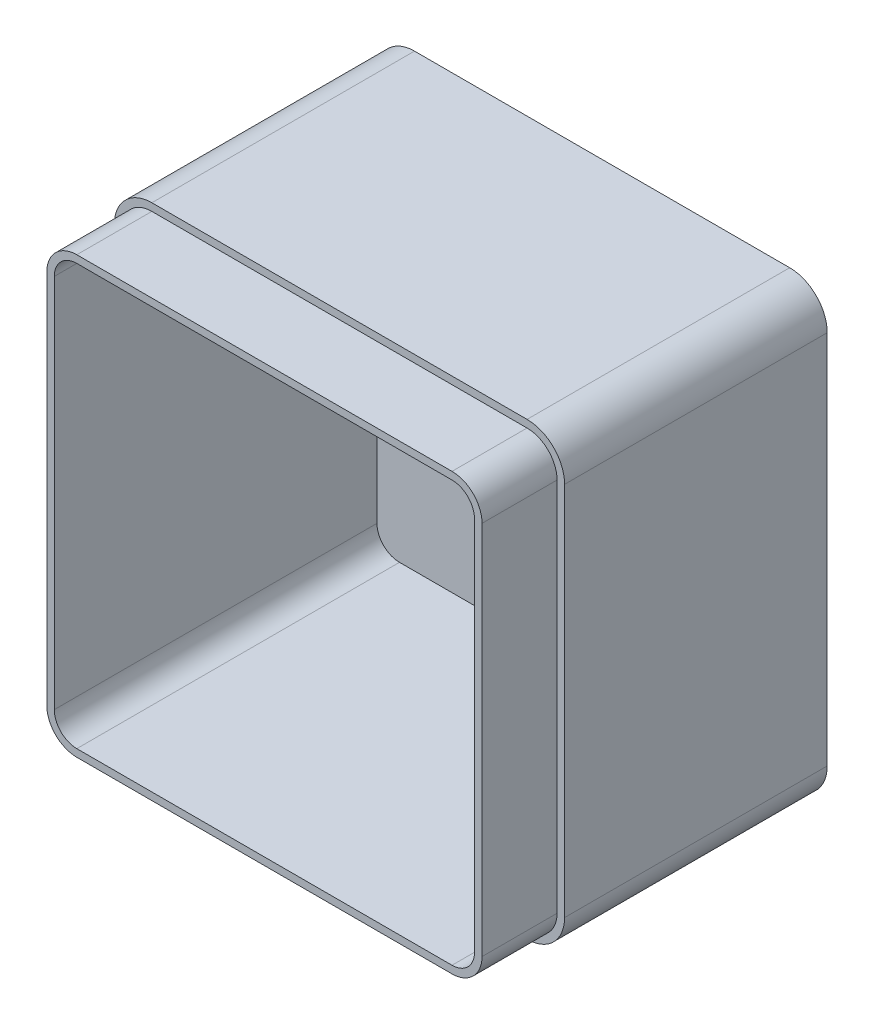
ISO-10303-21;
HEADER;
FILE_DESCRIPTION(('STEP AP214'),'2;1');
FILE_NAME('part.step','',(''),(''),'','','');
FILE_SCHEMA(('AUTOMOTIVE_DESIGN { 1 0 10303 214 1 1 1 1 }'));
ENDSEC;
DATA;
#1=APPLICATION_CONTEXT('core data for automotive mechanical design processes');
#2=APPLICATION_PROTOCOL_DEFINITION('international standard','automotive_design',2000,#1);
#3=PRODUCT_CONTEXT('',#1,'mechanical');
#4=PRODUCT('Part','Part','',(#3));
#5=PRODUCT_RELATED_PRODUCT_CATEGORY('part','',(#4));
#6=PRODUCT_DEFINITION_FORMATION('','',#4);
#7=PRODUCT_DEFINITION_CONTEXT('part definition',#1,'design');
#8=PRODUCT_DEFINITION('design','',#6,#7);
#9=PRODUCT_DEFINITION_SHAPE('','',#8);
#10=(LENGTH_UNIT() NAMED_UNIT(*) SI_UNIT(.MILLI.,.METRE.));
#11=(NAMED_UNIT(*) PLANE_ANGLE_UNIT() SI_UNIT($,.RADIAN.));
#12=(NAMED_UNIT(*) SI_UNIT($,.STERADIAN.) SOLID_ANGLE_UNIT());
#13=UNCERTAINTY_MEASURE_WITH_UNIT(LENGTH_MEASURE(1.E-05),#10,'distance_accuracy_value','');
#14=(GEOMETRIC_REPRESENTATION_CONTEXT(3) GLOBAL_UNCERTAINTY_ASSIGNED_CONTEXT((#13)) GLOBAL_UNIT_ASSIGNED_CONTEXT((#10,
#11,#12)) REPRESENTATION_CONTEXT('',''));
#15=CARTESIAN_POINT('',(0.,0.,0.));
#16=DIRECTION('',(0.,0.,1.));
#17=DIRECTION('',(1.,0.,0.));
#18=AXIS2_PLACEMENT_3D('',#15,#16,#17);
#19=CARTESIAN_POINT('',(0.,0.,90.));
#20=DIRECTION('',(0.,0.,-1.));
#21=DIRECTION('',(-1.,0.,0.));
#22=AXIS2_PLACEMENT_3D('',#19,#20,#21);
#23=PLANE('',#22);
#24=DIRECTION('',(0.,-1.,0.));
#25=VECTOR('',#24,1.);
#26=CARTESIAN_POINT('',(4.,0.,90.));
#27=LINE('',#26,#25);
#28=CARTESIAN_POINT('',(4.,110.,90.));
#29=VERTEX_POINT('',#28);
#30=CARTESIAN_POINT('',(4.,9.99999999999999,90.));
#31=VERTEX_POINT('',#30);
#32=EDGE_CURVE('E306',#29,#31,#27,.T.);
#33=ORIENTED_EDGE('',*,*,#32,.F.);
#34=CARTESIAN_POINT('',(10.,110.,90.));
#35=DIRECTION('',(0.,0.,-1.));
#36=DIRECTION('',(-1.,0.,0.));
#37=AXIS2_PLACEMENT_3D('',#34,#35,#36);
#38=CIRCLE('',#37,6.);
#39=CARTESIAN_POINT('',(9.99999999999999,116.,90.));
#40=VERTEX_POINT('',#39);
#41=EDGE_CURVE('E289',#40,#29,#38,.F.);
#42=ORIENTED_EDGE('',*,*,#41,.F.);
#43=DIRECTION('',(-1.,0.,0.));
#44=VECTOR('',#43,1.);
#45=CARTESIAN_POINT('',(0.,116.,90.));
#46=LINE('',#45,#44);
#47=CARTESIAN_POINT('',(110.,116.,90.));
#48=VERTEX_POINT('',#47);
#49=EDGE_CURVE('E315',#48,#40,#46,.T.);
#50=ORIENTED_EDGE('',*,*,#49,.F.);
#51=CARTESIAN_POINT('',(110.,110.,90.));
#52=DIRECTION('',(0.,0.,-1.));
#53=DIRECTION('',(-1.,0.,0.));
#54=AXIS2_PLACEMENT_3D('',#51,#52,#53);
#55=CIRCLE('',#54,6.);
#56=CARTESIAN_POINT('',(116.,110.,90.));
#57=VERTEX_POINT('',#56);
#58=EDGE_CURVE('E338',#57,#48,#55,.F.);
#59=ORIENTED_EDGE('',*,*,#58,.F.);
#60=DIRECTION('',(0.,1.,0.));
#61=VECTOR('',#60,1.);
#62=CARTESIAN_POINT('',(116.,0.,90.));
#63=LINE('',#62,#61);
#64=CARTESIAN_POINT('',(116.,9.99999999999999,90.));
#65=VERTEX_POINT('',#64);
#66=EDGE_CURVE('E336',#65,#57,#63,.T.);
#67=ORIENTED_EDGE('',*,*,#66,.F.);
#68=CARTESIAN_POINT('',(110.,10.,90.));
#69=DIRECTION('',(0.,0.,-1.));
#70=DIRECTION('',(-1.,0.,0.));
#71=AXIS2_PLACEMENT_3D('',#68,#69,#70);
#72=CIRCLE('',#71,6.);
#73=CARTESIAN_POINT('',(110.,4.,90.));
#74=VERTEX_POINT('',#73);
#75=EDGE_CURVE('E333',#74,#65,#72,.F.);
#76=ORIENTED_EDGE('',*,*,#75,.F.);
#77=DIRECTION('',(1.,0.,0.));
#78=VECTOR('',#77,1.);
#79=CARTESIAN_POINT('',(0.,4.,90.));
#80=LINE('',#79,#78);
#81=CARTESIAN_POINT('',(9.99999999999999,4.,90.));
#82=VERTEX_POINT('',#81);
#83=EDGE_CURVE('E331',#82,#74,#80,.T.);
#84=ORIENTED_EDGE('',*,*,#83,.F.);
#85=CARTESIAN_POINT('',(10.,10.,90.));
#86=DIRECTION('',(0.,0.,-1.));
#87=DIRECTION('',(-1.,0.,0.));
#88=AXIS2_PLACEMENT_3D('',#85,#86,#87);
#89=CIRCLE('',#88,6.);
#90=EDGE_CURVE('E322',#31,#82,#89,.F.);
#91=ORIENTED_EDGE('',*,*,#90,.F.);
#92=EDGE_LOOP('',(#33,#42,#50,#59,#67,#76,#84,#91));
#93=FACE_BOUND('',#92,.T.);
#94=CARTESIAN_POINT('',(10.,110.,90.));
#95=DIRECTION('',(0.,0.,1.));
#96=DIRECTION('',(1.,0.,0.));
#97=AXIS2_PLACEMENT_3D('',#94,#95,#96);
#98=CIRCLE('',#97,8.);
#99=CARTESIAN_POINT('',(9.99999999999999,118.,90.));
#100=VERTEX_POINT('',#99);
#101=CARTESIAN_POINT('',(2.,110.,90.));
#102=VERTEX_POINT('',#101);
#103=EDGE_CURVE('E241',#100,#102,#98,.T.);
#104=ORIENTED_EDGE('',*,*,#103,.T.);
#105=DIRECTION('',(0.,-1.,0.));
#106=VECTOR('',#105,1.);
#107=CARTESIAN_POINT('',(2.,110.,90.));
#108=LINE('',#107,#106);
#109=CARTESIAN_POINT('',(2.,9.99999999999999,90.));
#110=VERTEX_POINT('',#109);
#111=EDGE_CURVE('E201',#102,#110,#108,.T.);
#112=ORIENTED_EDGE('',*,*,#111,.T.);
#113=CARTESIAN_POINT('',(10.,10.,90.));
#114=DIRECTION('',(0.,0.,1.));
#115=DIRECTION('',(1.,0.,0.));
#116=AXIS2_PLACEMENT_3D('',#113,#114,#115);
#117=CIRCLE('',#116,8.);
#118=CARTESIAN_POINT('',(9.99999999999999,2.,90.));
#119=VERTEX_POINT('',#118);
#120=EDGE_CURVE('E50',#110,#119,#117,.T.);
#121=ORIENTED_EDGE('',*,*,#120,.T.);
#122=DIRECTION('',(1.,0.,0.));
#123=VECTOR('',#122,1.);
#124=CARTESIAN_POINT('',(9.99999999999999,2.,90.));
#125=LINE('',#124,#123);
#126=CARTESIAN_POINT('',(110.,2.,90.));
#127=VERTEX_POINT('',#126);
#128=EDGE_CURVE('E245',#119,#127,#125,.T.);
#129=ORIENTED_EDGE('',*,*,#128,.T.);
#130=CARTESIAN_POINT('',(110.,10.,90.));
#131=DIRECTION('',(0.,0.,1.));
#132=DIRECTION('',(1.,0.,0.));
#133=AXIS2_PLACEMENT_3D('',#130,#131,#132);
#134=CIRCLE('',#133,7.99999999999999);
#135=CARTESIAN_POINT('',(118.,10.,90.));
#136=VERTEX_POINT('',#135);
#137=EDGE_CURVE('E248',#127,#136,#134,.T.);
#138=ORIENTED_EDGE('',*,*,#137,.T.);
#139=DIRECTION('',(0.,1.,0.));
#140=VECTOR('',#139,1.);
#141=CARTESIAN_POINT('',(118.,9.99999999999999,90.));
#142=LINE('',#141,#140);
#143=CARTESIAN_POINT('',(118.,110.,90.));
#144=VERTEX_POINT('',#143);
#145=EDGE_CURVE('E251',#136,#144,#142,.T.);
#146=ORIENTED_EDGE('',*,*,#145,.T.);
#147=CARTESIAN_POINT('',(110.,110.,90.));
#148=DIRECTION('',(0.,0.,1.));
#149=DIRECTION('',(1.,0.,0.));
#150=AXIS2_PLACEMENT_3D('',#147,#148,#149);
#151=CIRCLE('',#150,7.99999999999999);
#152=CARTESIAN_POINT('',(110.,118.,90.));
#153=VERTEX_POINT('',#152);
#154=EDGE_CURVE('E224',#144,#153,#151,.T.);
#155=ORIENTED_EDGE('',*,*,#154,.T.);
#156=DIRECTION('',(-1.,0.,0.));
#157=VECTOR('',#156,1.);
#158=CARTESIAN_POINT('',(110.,118.,90.));
#159=LINE('',#158,#157);
#160=EDGE_CURVE('E221',#153,#100,#159,.T.);
#161=ORIENTED_EDGE('',*,*,#160,.T.);
#162=EDGE_LOOP('',(#104,#112,#121,#129,#138,#146,#155,#161));
#163=FACE_BOUND('',#162,.T.);
#164=ADVANCED_FACE('F35',(#93,#163),#23,.F.);
#165=CARTESIAN_POINT('',(4.,0.,90.));
#166=DIRECTION('',(1.,0.,0.));
#167=DIRECTION('',(0.,0.,-1.));
#168=AXIS2_PLACEMENT_3D('',#165,#166,#167);
#169=PLANE('',#168);
#170=DIRECTION('',(0.,-1.,0.));
#171=VECTOR('',#170,1.);
#172=CARTESIAN_POINT('',(4.,0.,4.));
#173=LINE('',#172,#171);
#174=CARTESIAN_POINT('',(4.,110.,4.));
#175=VERTEX_POINT('',#174);
#176=CARTESIAN_POINT('',(4.,9.99999999999999,4.));
#177=VERTEX_POINT('',#176);
#178=EDGE_CURVE('E283',#175,#177,#173,.T.);
#179=ORIENTED_EDGE('',*,*,#178,.F.);
#180=DIRECTION('',(0.,0.,-1.));
#181=VECTOR('',#180,1.);
#182=CARTESIAN_POINT('',(4.,110.,90.));
#183=LINE('',#182,#181);
#184=EDGE_CURVE('E290',#29,#175,#183,.T.);
#185=ORIENTED_EDGE('',*,*,#184,.F.);
#186=ORIENTED_EDGE('',*,*,#32,.T.);
#187=DIRECTION('',(0.,0.,-1.));
#188=VECTOR('',#187,1.);
#189=CARTESIAN_POINT('',(4.,9.99999999999999,90.));
#190=LINE('',#189,#188);
#191=EDGE_CURVE('E287',#177,#31,#190,.F.);
#192=ORIENTED_EDGE('',*,*,#191,.F.);
#193=EDGE_LOOP('',(#179,#185,#186,#192));
#194=FACE_BOUND('',#193,.T.);
#195=ADVANCED_FACE('F428',(#194),#169,.T.);
#196=CARTESIAN_POINT('',(0.,4.,90.));
#197=DIRECTION('',(0.,1.,0.));
#198=DIRECTION('',(0.,0.,1.));
#199=AXIS2_PLACEMENT_3D('',#196,#197,#198);
#200=PLANE('',#199);
#201=ORIENTED_EDGE('',*,*,#83,.T.);
#202=DIRECTION('',(0.,0.,1.));
#203=VECTOR('',#202,1.);
#204=CARTESIAN_POINT('',(110.,4.,90.));
#205=LINE('',#204,#203);
#206=CARTESIAN_POINT('',(110.,4.,4.));
#207=VERTEX_POINT('',#206);
#208=EDGE_CURVE('E313',#207,#74,#205,.T.);
#209=ORIENTED_EDGE('',*,*,#208,.F.);
#210=DIRECTION('',(1.,0.,0.));
#211=VECTOR('',#210,1.);
#212=CARTESIAN_POINT('',(0.,4.,4.));
#213=LINE('',#212,#211);
#214=CARTESIAN_POINT('',(9.99999999999999,4.,4.));
#215=VERTEX_POINT('',#214);
#216=EDGE_CURVE('E286',#215,#207,#213,.T.);
#217=ORIENTED_EDGE('',*,*,#216,.F.);
#218=DIRECTION('',(0.,0.,1.));
#219=VECTOR('',#218,1.);
#220=CARTESIAN_POINT('',(9.99999999999999,4.,90.));
#221=LINE('',#220,#219);
#222=EDGE_CURVE('E302',#82,#215,#221,.F.);
#223=ORIENTED_EDGE('',*,*,#222,.F.);
#224=EDGE_LOOP('',(#201,#209,#217,#223));
#225=FACE_BOUND('',#224,.T.);
#226=ADVANCED_FACE('F433',(#225),#200,.T.);
#227=CARTESIAN_POINT('',(116.,0.,90.));
#228=DIRECTION('',(-1.,0.,0.));
#229=DIRECTION('',(0.,0.,1.));
#230=AXIS2_PLACEMENT_3D('',#227,#228,#229);
#231=PLANE('',#230);
#232=ORIENTED_EDGE('',*,*,#66,.T.);
#233=DIRECTION('',(0.,0.,1.));
#234=VECTOR('',#233,1.);
#235=CARTESIAN_POINT('',(116.,110.,90.));
#236=LINE('',#235,#234);
#237=CARTESIAN_POINT('',(116.,110.,4.));
#238=VERTEX_POINT('',#237);
#239=EDGE_CURVE('E320',#238,#57,#236,.T.);
#240=ORIENTED_EDGE('',*,*,#239,.F.);
#241=DIRECTION('',(0.,1.,0.));
#242=VECTOR('',#241,1.);
#243=CARTESIAN_POINT('',(116.,0.,4.));
#244=LINE('',#243,#242);
#245=CARTESIAN_POINT('',(116.,9.99999999999999,4.));
#246=VERTEX_POINT('',#245);
#247=EDGE_CURVE('E296',#246,#238,#244,.T.);
#248=ORIENTED_EDGE('',*,*,#247,.F.);
#249=DIRECTION('',(0.,0.,1.));
#250=VECTOR('',#249,1.);
#251=CARTESIAN_POINT('',(116.,9.99999999999999,90.));
#252=LINE('',#251,#250);
#253=EDGE_CURVE('E316',#65,#246,#252,.F.);
#254=ORIENTED_EDGE('',*,*,#253,.F.);
#255=EDGE_LOOP('',(#232,#240,#248,#254));
#256=FACE_BOUND('',#255,.T.);
#257=ADVANCED_FACE('F462',(#256),#231,.T.);
#258=CARTESIAN_POINT('',(0.,116.,90.));
#259=DIRECTION('',(0.,-1.,0.));
#260=DIRECTION('',(0.,0.,-1.));
#261=AXIS2_PLACEMENT_3D('',#258,#259,#260);
#262=PLANE('',#261);
#263=ORIENTED_EDGE('',*,*,#49,.T.);
#264=DIRECTION('',(0.,0.,-1.));
#265=VECTOR('',#264,1.);
#266=CARTESIAN_POINT('',(9.99999999999999,116.,90.));
#267=LINE('',#266,#265);
#268=CARTESIAN_POINT('',(9.99999999999999,116.,4.));
#269=VERTEX_POINT('',#268);
#270=EDGE_CURVE('E319',#269,#40,#267,.F.);
#271=ORIENTED_EDGE('',*,*,#270,.F.);
#272=DIRECTION('',(-1.,0.,0.));
#273=VECTOR('',#272,1.);
#274=CARTESIAN_POINT('',(0.,116.,4.));
#275=LINE('',#274,#273);
#276=CARTESIAN_POINT('',(110.,116.,4.));
#277=VERTEX_POINT('',#276);
#278=EDGE_CURVE('E303',#277,#269,#275,.T.);
#279=ORIENTED_EDGE('',*,*,#278,.F.);
#280=DIRECTION('',(0.,0.,-1.));
#281=VECTOR('',#280,1.);
#282=CARTESIAN_POINT('',(110.,116.,90.));
#283=LINE('',#282,#281);
#284=EDGE_CURVE('E323',#48,#277,#283,.T.);
#285=ORIENTED_EDGE('',*,*,#284,.F.);
#286=EDGE_LOOP('',(#263,#271,#279,#285));
#287=FACE_BOUND('',#286,.T.);
#288=ADVANCED_FACE('F458',(#287),#262,.T.);
#289=CARTESIAN_POINT('',(0.,0.,4.));
#290=DIRECTION('',(0.,0.,-1.));
#291=DIRECTION('',(-1.,0.,0.));
#292=AXIS2_PLACEMENT_3D('',#289,#290,#291);
#293=PLANE('',#292);
#294=ORIENTED_EDGE('',*,*,#216,.T.);
#295=CARTESIAN_POINT('',(110.,10.,4.));
#296=DIRECTION('',(0.,0.,-1.));
#297=DIRECTION('',(-1.,0.,0.));
#298=AXIS2_PLACEMENT_3D('',#295,#296,#297);
#299=CIRCLE('',#298,6.);
#300=EDGE_CURVE('E298',#246,#207,#299,.T.);
#301=ORIENTED_EDGE('',*,*,#300,.F.);
#302=ORIENTED_EDGE('',*,*,#247,.T.);
#303=CARTESIAN_POINT('',(110.,110.,4.));
#304=DIRECTION('',(0.,0.,-1.));
#305=DIRECTION('',(-1.,0.,0.));
#306=AXIS2_PLACEMENT_3D('',#303,#304,#305);
#307=CIRCLE('',#306,6.);
#308=EDGE_CURVE('E301',#277,#238,#307,.T.);
#309=ORIENTED_EDGE('',*,*,#308,.F.);
#310=ORIENTED_EDGE('',*,*,#278,.T.);
#311=CARTESIAN_POINT('',(10.,110.,4.));
#312=DIRECTION('',(0.,0.,-1.));
#313=DIRECTION('',(-1.,0.,0.));
#314=AXIS2_PLACEMENT_3D('',#311,#312,#313);
#315=CIRCLE('',#314,6.);
#316=EDGE_CURVE('E299',#175,#269,#315,.T.);
#317=ORIENTED_EDGE('',*,*,#316,.F.);
#318=ORIENTED_EDGE('',*,*,#178,.T.);
#319=CARTESIAN_POINT('',(10.,10.,4.));
#320=DIRECTION('',(0.,0.,-1.));
#321=DIRECTION('',(-1.,0.,0.));
#322=AXIS2_PLACEMENT_3D('',#319,#320,#321);
#323=CIRCLE('',#322,6.);
#324=EDGE_CURVE('E293',#215,#177,#323,.T.);
#325=ORIENTED_EDGE('',*,*,#324,.F.);
#326=EDGE_LOOP('',(#294,#301,#302,#309,#310,#317,#318,#325));
#327=FACE_BOUND('',#326,.T.);
#328=ADVANCED_FACE('F454',(#327),#293,.F.);
#329=CARTESIAN_POINT('',(10.,10.,90.));
#330=DIRECTION('',(0.,0.,-1.));
#331=DIRECTION('',(-1.,0.,0.));
#332=AXIS2_PLACEMENT_3D('',#329,#330,#331);
#333=CYLINDRICAL_SURFACE('',#332,6.);
#334=ORIENTED_EDGE('',*,*,#90,.T.);
#335=ORIENTED_EDGE('',*,*,#222,.T.);
#336=ORIENTED_EDGE('',*,*,#324,.T.);
#337=ORIENTED_EDGE('',*,*,#191,.T.);
#338=EDGE_LOOP('',(#334,#335,#336,#337));
#339=FACE_BOUND('',#338,.T.);
#340=ADVANCED_FACE('F450',(#339),#333,.F.);
#341=CARTESIAN_POINT('',(110.,10.,90.));
#342=DIRECTION('',(0.,0.,-1.));
#343=DIRECTION('',(-1.,0.,0.));
#344=AXIS2_PLACEMENT_3D('',#341,#342,#343);
#345=CYLINDRICAL_SURFACE('',#344,6.);
#346=ORIENTED_EDGE('',*,*,#75,.T.);
#347=ORIENTED_EDGE('',*,*,#253,.T.);
#348=ORIENTED_EDGE('',*,*,#300,.T.);
#349=ORIENTED_EDGE('',*,*,#208,.T.);
#350=EDGE_LOOP('',(#346,#347,#348,#349));
#351=FACE_BOUND('',#350,.T.);
#352=ADVANCED_FACE('F446',(#351),#345,.F.);
#353=CARTESIAN_POINT('',(110.,110.,90.));
#354=DIRECTION('',(0.,0.,-1.));
#355=DIRECTION('',(-1.,0.,0.));
#356=AXIS2_PLACEMENT_3D('',#353,#354,#355);
#357=CYLINDRICAL_SURFACE('',#356,6.);
#358=ORIENTED_EDGE('',*,*,#58,.T.);
#359=ORIENTED_EDGE('',*,*,#284,.T.);
#360=ORIENTED_EDGE('',*,*,#308,.T.);
#361=ORIENTED_EDGE('',*,*,#239,.T.);
#362=EDGE_LOOP('',(#358,#359,#360,#361));
#363=FACE_BOUND('',#362,.T.);
#364=ADVANCED_FACE('F442',(#363),#357,.F.);
#365=CARTESIAN_POINT('',(10.,110.,90.));
#366=DIRECTION('',(0.,0.,-1.));
#367=DIRECTION('',(-1.,0.,0.));
#368=AXIS2_PLACEMENT_3D('',#365,#366,#367);
#369=CYLINDRICAL_SURFACE('',#368,6.);
#370=ORIENTED_EDGE('',*,*,#41,.T.);
#371=ORIENTED_EDGE('',*,*,#184,.T.);
#372=ORIENTED_EDGE('',*,*,#316,.T.);
#373=ORIENTED_EDGE('',*,*,#270,.T.);
#374=EDGE_LOOP('',(#370,#371,#372,#373));
#375=FACE_BOUND('',#374,.T.);
#376=ADVANCED_FACE('F439',(#375),#369,.F.);
#377=CARTESIAN_POINT('',(10.,110.,70.));
#378=DIRECTION('',(0.,0.,1.));
#379=DIRECTION('',(1.,0.,0.));
#380=AXIS2_PLACEMENT_3D('',#377,#378,#379);
#381=PLANE('',#380);
#382=DIRECTION('',(-1.,0.,0.));
#383=VECTOR('',#382,1.);
#384=CARTESIAN_POINT('',(110.,118.,70.));
#385=LINE('',#384,#383);
#386=CARTESIAN_POINT('',(110.,118.,70.));
#387=VERTEX_POINT('',#386);
#388=CARTESIAN_POINT('',(9.99999999999999,118.,70.));
#389=VERTEX_POINT('',#388);
#390=EDGE_CURVE('E207',#387,#389,#385,.T.);
#391=ORIENTED_EDGE('',*,*,#390,.F.);
#392=CARTESIAN_POINT('',(110.,110.,70.));
#393=DIRECTION('',(0.,0.,1.));
#394=DIRECTION('',(1.,0.,0.));
#395=AXIS2_PLACEMENT_3D('',#392,#393,#394);
#396=CIRCLE('',#395,7.99999999999999);
#397=CARTESIAN_POINT('',(118.,110.,70.));
#398=VERTEX_POINT('',#397);
#399=EDGE_CURVE('E237',#398,#387,#396,.T.);
#400=ORIENTED_EDGE('',*,*,#399,.F.);
#401=DIRECTION('',(0.,1.,0.));
#402=VECTOR('',#401,1.);
#403=CARTESIAN_POINT('',(118.,9.99999999999999,70.));
#404=LINE('',#403,#402);
#405=CARTESIAN_POINT('',(118.,10.,70.));
#406=VERTEX_POINT('',#405);
#407=EDGE_CURVE('E234',#406,#398,#404,.T.);
#408=ORIENTED_EDGE('',*,*,#407,.F.);
#409=CARTESIAN_POINT('',(110.,10.,70.));
#410=DIRECTION('',(0.,0.,1.));
#411=DIRECTION('',(1.,0.,0.));
#412=AXIS2_PLACEMENT_3D('',#409,#410,#411);
#413=CIRCLE('',#412,7.99999999999999);
#414=CARTESIAN_POINT('',(110.,2.,70.));
#415=VERTEX_POINT('',#414);
#416=EDGE_CURVE('E231',#415,#406,#413,.T.);
#417=ORIENTED_EDGE('',*,*,#416,.F.);
#418=DIRECTION('',(1.,0.,0.));
#419=VECTOR('',#418,1.);
#420=CARTESIAN_POINT('',(9.99999999999999,2.,70.));
#421=LINE('',#420,#419);
#422=CARTESIAN_POINT('',(9.99999999999999,2.,70.));
#423=VERTEX_POINT('',#422);
#424=EDGE_CURVE('E228',#423,#415,#421,.T.);
#425=ORIENTED_EDGE('',*,*,#424,.F.);
#426=CARTESIAN_POINT('',(10.,10.,70.));
#427=DIRECTION('',(0.,0.,1.));
#428=DIRECTION('',(1.,0.,0.));
#429=AXIS2_PLACEMENT_3D('',#426,#427,#428);
#430=CIRCLE('',#429,8.);
#431=CARTESIAN_POINT('',(2.,9.99999999999999,70.));
#432=VERTEX_POINT('',#431);
#433=EDGE_CURVE('E217',#432,#423,#430,.T.);
#434=ORIENTED_EDGE('',*,*,#433,.F.);
#435=DIRECTION('',(0.,-1.,0.));
#436=VECTOR('',#435,1.);
#437=CARTESIAN_POINT('',(2.,110.,70.));
#438=LINE('',#437,#436);
#439=CARTESIAN_POINT('',(2.,110.,70.));
#440=VERTEX_POINT('',#439);
#441=EDGE_CURVE('E199',#440,#432,#438,.T.);
#442=ORIENTED_EDGE('',*,*,#441,.F.);
#443=CARTESIAN_POINT('',(10.,110.,70.));
#444=DIRECTION('',(0.,0.,1.));
#445=DIRECTION('',(1.,0.,0.));
#446=AXIS2_PLACEMENT_3D('',#443,#444,#445);
#447=CIRCLE('',#446,8.);
#448=EDGE_CURVE('E213',#389,#440,#447,.T.);
#449=ORIENTED_EDGE('',*,*,#448,.F.);
#450=EDGE_LOOP('',(#391,#400,#408,#417,#425,#434,#442,#449));
#451=FACE_BOUND('',#450,.T.);
#452=CARTESIAN_POINT('',(10.,110.,70.));
#453=DIRECTION('',(0.,0.,1.));
#454=DIRECTION('',(1.,0.,0.));
#455=AXIS2_PLACEMENT_3D('',#452,#453,#454);
#456=CIRCLE('',#455,10.);
#457=CARTESIAN_POINT('',(10.,120.,70.));
#458=VERTEX_POINT('',#457);
#459=CARTESIAN_POINT('',(0.,110.,70.));
#460=VERTEX_POINT('',#459);
#461=EDGE_CURVE('E257',#458,#460,#456,.T.);
#462=ORIENTED_EDGE('',*,*,#461,.T.);
#463=DIRECTION('',(0.,-1.,0.));
#464=VECTOR('',#463,1.);
#465=CARTESIAN_POINT('',(0.,110.,70.));
#466=LINE('',#465,#464);
#467=CARTESIAN_POINT('',(0.,10.,70.));
#468=VERTEX_POINT('',#467);
#469=EDGE_CURVE('E270',#460,#468,#466,.T.);
#470=ORIENTED_EDGE('',*,*,#469,.T.);
#471=CARTESIAN_POINT('',(10.,10.,70.));
#472=DIRECTION('',(0.,0.,1.));
#473=DIRECTION('',(1.,0.,0.));
#474=AXIS2_PLACEMENT_3D('',#471,#472,#473);
#475=CIRCLE('',#474,10.);
#476=CARTESIAN_POINT('',(9.99999999999999,0.,70.));
#477=VERTEX_POINT('',#476);
#478=EDGE_CURVE('E272',#468,#477,#475,.T.);
#479=ORIENTED_EDGE('',*,*,#478,.T.);
#480=DIRECTION('',(1.,0.,0.));
#481=VECTOR('',#480,1.);
#482=CARTESIAN_POINT('',(9.99999999999999,0.,70.));
#483=LINE('',#482,#481);
#484=CARTESIAN_POINT('',(110.,0.,70.));
#485=VERTEX_POINT('',#484);
#486=EDGE_CURVE('E274',#477,#485,#483,.T.);
#487=ORIENTED_EDGE('',*,*,#486,.T.);
#488=CARTESIAN_POINT('',(110.,10.,70.));
#489=DIRECTION('',(0.,0.,1.));
#490=DIRECTION('',(1.,0.,0.));
#491=AXIS2_PLACEMENT_3D('',#488,#489,#490);
#492=CIRCLE('',#491,9.99999999999999);
#493=CARTESIAN_POINT('',(120.,10.,70.));
#494=VERTEX_POINT('',#493);
#495=EDGE_CURVE('E276',#485,#494,#492,.T.);
#496=ORIENTED_EDGE('',*,*,#495,.T.);
#497=DIRECTION('',(0.,1.,0.));
#498=VECTOR('',#497,1.);
#499=CARTESIAN_POINT('',(120.,10.,70.));
#500=LINE('',#499,#498);
#501=CARTESIAN_POINT('',(120.,110.,70.));
#502=VERTEX_POINT('',#501);
#503=EDGE_CURVE('E278',#494,#502,#500,.T.);
#504=ORIENTED_EDGE('',*,*,#503,.T.);
#505=CARTESIAN_POINT('',(110.,110.,70.));
#506=DIRECTION('',(0.,0.,1.));
#507=DIRECTION('',(1.,0.,0.));
#508=AXIS2_PLACEMENT_3D('',#505,#506,#507);
#509=CIRCLE('',#508,9.99999999999999);
#510=CARTESIAN_POINT('',(110.,120.,70.));
#511=VERTEX_POINT('',#510);
#512=EDGE_CURVE('E280',#502,#511,#509,.T.);
#513=ORIENTED_EDGE('',*,*,#512,.T.);
#514=DIRECTION('',(-1.,0.,0.));
#515=VECTOR('',#514,1.);
#516=CARTESIAN_POINT('',(110.,120.,70.));
#517=LINE('',#516,#515);
#518=EDGE_CURVE('E58',#511,#458,#517,.T.);
#519=ORIENTED_EDGE('',*,*,#518,.T.);
#520=EDGE_LOOP('',(#462,#470,#479,#487,#496,#504,#513,#519));
#521=FACE_BOUND('',#520,.T.);
#522=ADVANCED_FACE('F212',(#451,#521),#381,.T.);
#523=CARTESIAN_POINT('',(10.,110.,70.));
#524=DIRECTION('',(0.,0.,1.));
#525=DIRECTION('',(1.,0.,0.));
#526=AXIS2_PLACEMENT_3D('',#523,#524,#525);
#527=CYLINDRICAL_SURFACE('',#526,8.);
#528=ORIENTED_EDGE('',*,*,#103,.F.);
#529=DIRECTION('',(0.,0.,1.));
#530=VECTOR('',#529,1.);
#531=CARTESIAN_POINT('',(9.99999999999999,118.,70.));
#532=LINE('',#531,#530);
#533=EDGE_CURVE('E220',#389,#100,#532,.T.);
#534=ORIENTED_EDGE('',*,*,#533,.F.);
#535=ORIENTED_EDGE('',*,*,#448,.T.);
#536=DIRECTION('',(0.,0.,1.));
#537=VECTOR('',#536,1.);
#538=CARTESIAN_POINT('',(2.,110.,70.));
#539=LINE('',#538,#537);
#540=EDGE_CURVE('E196',#440,#102,#539,.T.);
#541=ORIENTED_EDGE('',*,*,#540,.T.);
#542=EDGE_LOOP('',(#528,#534,#535,#541));
#543=FACE_BOUND('',#542,.T.);
#544=ADVANCED_FACE('F219',(#543),#527,.T.);
#545=CARTESIAN_POINT('',(110.,118.,70.));
#546=DIRECTION('',(0.,1.,0.));
#547=DIRECTION('',(0.,0.,1.));
#548=AXIS2_PLACEMENT_3D('',#545,#546,#547);
#549=PLANE('',#548);
#550=ORIENTED_EDGE('',*,*,#160,.F.);
#551=DIRECTION('',(0.,0.,1.));
#552=VECTOR('',#551,1.);
#553=CARTESIAN_POINT('',(110.,118.,70.));
#554=LINE('',#553,#552);
#555=EDGE_CURVE('E258',#387,#153,#554,.T.);
#556=ORIENTED_EDGE('',*,*,#555,.F.);
#557=ORIENTED_EDGE('',*,*,#390,.T.);
#558=ORIENTED_EDGE('',*,*,#533,.T.);
#559=EDGE_LOOP('',(#550,#556,#557,#558));
#560=FACE_BOUND('',#559,.T.);
#561=ADVANCED_FACE('F473',(#560),#549,.T.);
#562=CARTESIAN_POINT('',(110.,110.,70.));
#563=DIRECTION('',(0.,0.,1.));
#564=DIRECTION('',(1.,0.,0.));
#565=AXIS2_PLACEMENT_3D('',#562,#563,#564);
#566=CYLINDRICAL_SURFACE('',#565,7.99999999999999);
#567=ORIENTED_EDGE('',*,*,#154,.F.);
#568=DIRECTION('',(0.,0.,1.));
#569=VECTOR('',#568,1.);
#570=CARTESIAN_POINT('',(118.,110.,70.));
#571=LINE('',#570,#569);
#572=EDGE_CURVE('E260',#398,#144,#571,.T.);
#573=ORIENTED_EDGE('',*,*,#572,.F.);
#574=ORIENTED_EDGE('',*,*,#399,.T.);
#575=ORIENTED_EDGE('',*,*,#555,.T.);
#576=EDGE_LOOP('',(#567,#573,#574,#575));
#577=FACE_BOUND('',#576,.T.);
#578=ADVANCED_FACE('F488',(#577),#566,.T.);
#579=CARTESIAN_POINT('',(118.,9.99999999999999,70.));
#580=DIRECTION('',(1.,0.,0.));
#581=DIRECTION('',(0.,0.,-1.));
#582=AXIS2_PLACEMENT_3D('',#579,#580,#581);
#583=PLANE('',#582);
#584=ORIENTED_EDGE('',*,*,#145,.F.);
#585=DIRECTION('',(0.,0.,1.));
#586=VECTOR('',#585,1.);
#587=CARTESIAN_POINT('',(118.,10.,70.));
#588=LINE('',#587,#586);
#589=EDGE_CURVE('E262',#406,#136,#588,.T.);
#590=ORIENTED_EDGE('',*,*,#589,.F.);
#591=ORIENTED_EDGE('',*,*,#407,.T.);
#592=ORIENTED_EDGE('',*,*,#572,.T.);
#593=EDGE_LOOP('',(#584,#590,#591,#592));
#594=FACE_BOUND('',#593,.T.);
#595=ADVANCED_FACE('F484',(#594),#583,.T.);
#596=CARTESIAN_POINT('',(110.,10.,70.));
#597=DIRECTION('',(0.,0.,1.));
#598=DIRECTION('',(1.,0.,0.));
#599=AXIS2_PLACEMENT_3D('',#596,#597,#598);
#600=CYLINDRICAL_SURFACE('',#599,7.99999999999999);
#601=ORIENTED_EDGE('',*,*,#137,.F.);
#602=DIRECTION('',(0.,0.,1.));
#603=VECTOR('',#602,1.);
#604=CARTESIAN_POINT('',(110.,2.,70.));
#605=LINE('',#604,#603);
#606=EDGE_CURVE('E264',#415,#127,#605,.T.);
#607=ORIENTED_EDGE('',*,*,#606,.F.);
#608=ORIENTED_EDGE('',*,*,#416,.T.);
#609=ORIENTED_EDGE('',*,*,#589,.T.);
#610=EDGE_LOOP('',(#601,#607,#608,#609));
#611=FACE_BOUND('',#610,.T.);
#612=ADVANCED_FACE('F480',(#611),#600,.T.);
#613=CARTESIAN_POINT('',(9.99999999999999,2.,70.));
#614=DIRECTION('',(0.,-1.,0.));
#615=DIRECTION('',(0.,0.,-1.));
#616=AXIS2_PLACEMENT_3D('',#613,#614,#615);
#617=PLANE('',#616);
#618=ORIENTED_EDGE('',*,*,#128,.F.);
#619=DIRECTION('',(0.,0.,1.));
#620=VECTOR('',#619,1.);
#621=CARTESIAN_POINT('',(9.99999999999999,2.,70.));
#622=LINE('',#621,#620);
#623=EDGE_CURVE('E266',#423,#119,#622,.T.);
#624=ORIENTED_EDGE('',*,*,#623,.F.);
#625=ORIENTED_EDGE('',*,*,#424,.T.);
#626=ORIENTED_EDGE('',*,*,#606,.T.);
#627=EDGE_LOOP('',(#618,#624,#625,#626));
#628=FACE_BOUND('',#627,.T.);
#629=ADVANCED_FACE('F477',(#628),#617,.T.);
#630=CARTESIAN_POINT('',(10.,10.,70.));
#631=DIRECTION('',(0.,0.,1.));
#632=DIRECTION('',(1.,0.,0.));
#633=AXIS2_PLACEMENT_3D('',#630,#631,#632);
#634=CYLINDRICAL_SURFACE('',#633,8.);
#635=ORIENTED_EDGE('',*,*,#120,.F.);
#636=DIRECTION('',(0.,0.,1.));
#637=VECTOR('',#636,1.);
#638=CARTESIAN_POINT('',(2.,9.99999999999999,70.));
#639=LINE('',#638,#637);
#640=EDGE_CURVE('E206',#432,#110,#639,.T.);
#641=ORIENTED_EDGE('',*,*,#640,.F.);
#642=ORIENTED_EDGE('',*,*,#433,.T.);
#643=ORIENTED_EDGE('',*,*,#623,.T.);
#644=EDGE_LOOP('',(#635,#641,#642,#643));
#645=FACE_BOUND('',#644,.T.);
#646=ADVANCED_FACE('F423',(#645),#634,.T.);
#647=CARTESIAN_POINT('',(2.,110.,70.));
#648=DIRECTION('',(-1.,0.,0.));
#649=DIRECTION('',(0.,0.,1.));
#650=AXIS2_PLACEMENT_3D('',#647,#648,#649);
#651=PLANE('',#650);
#652=ORIENTED_EDGE('',*,*,#111,.F.);
#653=ORIENTED_EDGE('',*,*,#540,.F.);
#654=ORIENTED_EDGE('',*,*,#441,.T.);
#655=ORIENTED_EDGE('',*,*,#640,.T.);
#656=EDGE_LOOP('',(#652,#653,#654,#655));
#657=FACE_BOUND('',#656,.T.);
#658=ADVANCED_FACE('F198',(#657),#651,.T.);
#659=CARTESIAN_POINT('',(0.,0.,0.));
#660=DIRECTION('',(0.,0.,-1.));
#661=DIRECTION('',(-1.,0.,0.));
#662=AXIS2_PLACEMENT_3D('',#659,#660,#661);
#663=PLANE('',#662);
#664=DIRECTION('',(1.,0.,0.));
#665=VECTOR('',#664,1.);
#666=CARTESIAN_POINT('',(0.,0.,0.));
#667=LINE('',#666,#665);
#668=CARTESIAN_POINT('',(10.,0.,0.));
#669=VERTEX_POINT('',#668);
#670=CARTESIAN_POINT('',(110.,0.,0.));
#671=VERTEX_POINT('',#670);
#672=EDGE_CURVE('E346',#669,#671,#667,.T.);
#673=ORIENTED_EDGE('',*,*,#672,.F.);
#674=CARTESIAN_POINT('',(10.,10.,0.));
#675=DIRECTION('',(0.,0.,-1.));
#676=DIRECTION('',(-1.,0.,0.));
#677=AXIS2_PLACEMENT_3D('',#674,#675,#676);
#678=CIRCLE('',#677,10.);
#679=CARTESIAN_POINT('',(0.,10.,0.));
#680=VERTEX_POINT('',#679);
#681=EDGE_CURVE('E366',#669,#680,#678,.T.);
#682=ORIENTED_EDGE('',*,*,#681,.T.);
#683=DIRECTION('',(0.,-1.,0.));
#684=VECTOR('',#683,1.);
#685=CARTESIAN_POINT('',(0.,0.,0.));
#686=LINE('',#685,#684);
#687=CARTESIAN_POINT('',(0.,110.,0.));
#688=VERTEX_POINT('',#687);
#689=EDGE_CURVE('E326',#688,#680,#686,.T.);
#690=ORIENTED_EDGE('',*,*,#689,.F.);
#691=CARTESIAN_POINT('',(10.,110.,0.));
#692=DIRECTION('',(0.,0.,-1.));
#693=DIRECTION('',(-1.,0.,0.));
#694=AXIS2_PLACEMENT_3D('',#691,#692,#693);
#695=CIRCLE('',#694,10.);
#696=CARTESIAN_POINT('',(10.,120.,0.));
#697=VERTEX_POINT('',#696);
#698=EDGE_CURVE('E360',#688,#697,#695,.T.);
#699=ORIENTED_EDGE('',*,*,#698,.T.);
#700=DIRECTION('',(-1.,0.,0.));
#701=VECTOR('',#700,1.);
#702=CARTESIAN_POINT('',(0.,120.,0.));
#703=LINE('',#702,#701);
#704=CARTESIAN_POINT('',(110.,120.,0.));
#705=VERTEX_POINT('',#704);
#706=EDGE_CURVE('E352',#705,#697,#703,.T.);
#707=ORIENTED_EDGE('',*,*,#706,.F.);
#708=CARTESIAN_POINT('',(110.,110.,0.));
#709=DIRECTION('',(0.,0.,-1.));
#710=DIRECTION('',(-1.,0.,0.));
#711=AXIS2_PLACEMENT_3D('',#708,#709,#710);
#712=CIRCLE('',#711,10.);
#713=CARTESIAN_POINT('',(120.,110.,0.));
#714=VERTEX_POINT('',#713);
#715=EDGE_CURVE('E362',#705,#714,#712,.T.);
#716=ORIENTED_EDGE('',*,*,#715,.T.);
#717=DIRECTION('',(0.,1.,0.));
#718=VECTOR('',#717,1.);
#719=CARTESIAN_POINT('',(120.,0.,0.));
#720=LINE('',#719,#718);
#721=CARTESIAN_POINT('',(120.,10.,0.));
#722=VERTEX_POINT('',#721);
#723=EDGE_CURVE('E349',#722,#714,#720,.T.);
#724=ORIENTED_EDGE('',*,*,#723,.F.);
#725=CARTESIAN_POINT('',(110.,10.,0.));
#726=DIRECTION('',(0.,0.,-1.));
#727=DIRECTION('',(-1.,0.,0.));
#728=AXIS2_PLACEMENT_3D('',#725,#726,#727);
#729=CIRCLE('',#728,10.);
#730=EDGE_CURVE('E364',#722,#671,#729,.T.);
#731=ORIENTED_EDGE('',*,*,#730,.T.);
#732=EDGE_LOOP('',(#673,#682,#690,#699,#707,#716,#724,#731));
#733=FACE_BOUND('',#732,.T.);
#734=ADVANCED_FACE('F416',(#733),#663,.T.);
#735=CARTESIAN_POINT('',(10.,110.,90.));
#736=DIRECTION('',(0.,0.,-1.));
#737=DIRECTION('',(-1.,0.,0.));
#738=AXIS2_PLACEMENT_3D('',#735,#736,#737);
#739=CYLINDRICAL_SURFACE('',#738,10.);
#740=DIRECTION('',(0.,0.,-1.));
#741=VECTOR('',#740,1.);
#742=CARTESIAN_POINT('',(0.,110.,90.));
#743=LINE('',#742,#741);
#744=EDGE_CURVE('E368',#460,#688,#743,.T.);
#745=ORIENTED_EDGE('',*,*,#744,.F.);
#746=ORIENTED_EDGE('',*,*,#461,.F.);
#747=DIRECTION('',(0.,0.,-1.));
#748=VECTOR('',#747,1.);
#749=CARTESIAN_POINT('',(10.,120.,90.));
#750=LINE('',#749,#748);
#751=EDGE_CURVE('E43',#697,#458,#750,.F.);
#752=ORIENTED_EDGE('',*,*,#751,.F.);
#753=ORIENTED_EDGE('',*,*,#698,.F.);
#754=EDGE_LOOP('',(#745,#746,#752,#753));
#755=FACE_BOUND('',#754,.T.);
#756=ADVANCED_FACE('F37',(#755),#739,.T.);
#757=CARTESIAN_POINT('',(110.,110.,90.));
#758=DIRECTION('',(0.,0.,-1.));
#759=DIRECTION('',(-1.,0.,0.));
#760=AXIS2_PLACEMENT_3D('',#757,#758,#759);
#761=CYLINDRICAL_SURFACE('',#760,10.);
#762=DIRECTION('',(0.,0.,-1.));
#763=VECTOR('',#762,1.);
#764=CARTESIAN_POINT('',(110.,120.,90.));
#765=LINE('',#764,#763);
#766=EDGE_CURVE('E11',#511,#705,#765,.T.);
#767=ORIENTED_EDGE('',*,*,#766,.F.);
#768=ORIENTED_EDGE('',*,*,#512,.F.);
#769=DIRECTION('',(0.,0.,-1.));
#770=VECTOR('',#769,1.);
#771=CARTESIAN_POINT('',(120.,110.,90.));
#772=LINE('',#771,#770);
#773=EDGE_CURVE('E373',#714,#502,#772,.F.);
#774=ORIENTED_EDGE('',*,*,#773,.F.);
#775=ORIENTED_EDGE('',*,*,#715,.F.);
#776=EDGE_LOOP('',(#767,#768,#774,#775));
#777=FACE_BOUND('',#776,.T.);
#778=ADVANCED_FACE('F414',(#777),#761,.T.);
#779=CARTESIAN_POINT('',(0.,120.,90.));
#780=DIRECTION('',(0.,-1.,0.));
#781=DIRECTION('',(0.,0.,-1.));
#782=AXIS2_PLACEMENT_3D('',#779,#780,#781);
#783=PLANE('',#782);
#784=ORIENTED_EDGE('',*,*,#518,.F.);
#785=ORIENTED_EDGE('',*,*,#766,.T.);
#786=ORIENTED_EDGE('',*,*,#706,.T.);
#787=ORIENTED_EDGE('',*,*,#751,.T.);
#788=EDGE_LOOP('',(#784,#785,#786,#787));
#789=FACE_BOUND('',#788,.T.);
#790=ADVANCED_FACE('F380',(#789),#783,.F.);
#791=CARTESIAN_POINT('',(110.,10.,90.));
#792=DIRECTION('',(0.,0.,-1.));
#793=DIRECTION('',(-1.,0.,0.));
#794=AXIS2_PLACEMENT_3D('',#791,#792,#793);
#795=CYLINDRICAL_SURFACE('',#794,10.);
#796=DIRECTION('',(0.,0.,-1.));
#797=VECTOR('',#796,1.);
#798=CARTESIAN_POINT('',(120.,10.,90.));
#799=LINE('',#798,#797);
#800=EDGE_CURVE('E376',#494,#722,#799,.T.);
#801=ORIENTED_EDGE('',*,*,#800,.F.);
#802=ORIENTED_EDGE('',*,*,#495,.F.);
#803=DIRECTION('',(0.,0.,-1.));
#804=VECTOR('',#803,1.);
#805=CARTESIAN_POINT('',(110.,0.,90.));
#806=LINE('',#805,#804);
#807=EDGE_CURVE('E355',#671,#485,#806,.F.);
#808=ORIENTED_EDGE('',*,*,#807,.F.);
#809=ORIENTED_EDGE('',*,*,#730,.F.);
#810=EDGE_LOOP('',(#801,#802,#808,#809));
#811=FACE_BOUND('',#810,.T.);
#812=ADVANCED_FACE('F405',(#811),#795,.T.);
#813=CARTESIAN_POINT('',(120.,0.,90.));
#814=DIRECTION('',(-1.,0.,0.));
#815=DIRECTION('',(0.,0.,1.));
#816=AXIS2_PLACEMENT_3D('',#813,#814,#815);
#817=PLANE('',#816);
#818=ORIENTED_EDGE('',*,*,#503,.F.);
#819=ORIENTED_EDGE('',*,*,#800,.T.);
#820=ORIENTED_EDGE('',*,*,#723,.T.);
#821=ORIENTED_EDGE('',*,*,#773,.T.);
#822=EDGE_LOOP('',(#818,#819,#820,#821));
#823=FACE_BOUND('',#822,.T.);
#824=ADVANCED_FACE('F410',(#823),#817,.F.);
#825=CARTESIAN_POINT('',(10.,10.,90.));
#826=DIRECTION('',(0.,0.,-1.));
#827=DIRECTION('',(-1.,0.,0.));
#828=AXIS2_PLACEMENT_3D('',#825,#826,#827);
#829=CYLINDRICAL_SURFACE('',#828,10.);
#830=DIRECTION('',(0.,0.,-1.));
#831=VECTOR('',#830,1.);
#832=CARTESIAN_POINT('',(10.,0.,90.));
#833=LINE('',#832,#831);
#834=EDGE_CURVE('E358',#477,#669,#833,.T.);
#835=ORIENTED_EDGE('',*,*,#834,.F.);
#836=ORIENTED_EDGE('',*,*,#478,.F.);
#837=DIRECTION('',(0.,0.,-1.));
#838=VECTOR('',#837,1.);
#839=CARTESIAN_POINT('',(0.,10.,90.));
#840=LINE('',#839,#838);
#841=EDGE_CURVE('E370',#680,#468,#840,.F.);
#842=ORIENTED_EDGE('',*,*,#841,.F.);
#843=ORIENTED_EDGE('',*,*,#681,.F.);
#844=EDGE_LOOP('',(#835,#836,#842,#843));
#845=FACE_BOUND('',#844,.T.);
#846=ADVANCED_FACE('F395',(#845),#829,.T.);
#847=CARTESIAN_POINT('',(0.,0.,90.));
#848=DIRECTION('',(0.,1.,0.));
#849=DIRECTION('',(0.,0.,1.));
#850=AXIS2_PLACEMENT_3D('',#847,#848,#849);
#851=PLANE('',#850);
#852=ORIENTED_EDGE('',*,*,#486,.F.);
#853=ORIENTED_EDGE('',*,*,#834,.T.);
#854=ORIENTED_EDGE('',*,*,#672,.T.);
#855=ORIENTED_EDGE('',*,*,#807,.T.);
#856=EDGE_LOOP('',(#852,#853,#854,#855));
#857=FACE_BOUND('',#856,.T.);
#858=ADVANCED_FACE('F400',(#857),#851,.F.);
#859=CARTESIAN_POINT('',(0.,0.,90.));
#860=DIRECTION('',(1.,0.,0.));
#861=DIRECTION('',(0.,0.,-1.));
#862=AXIS2_PLACEMENT_3D('',#859,#860,#861);
#863=PLANE('',#862);
#864=ORIENTED_EDGE('',*,*,#469,.F.);
#865=ORIENTED_EDGE('',*,*,#744,.T.);
#866=ORIENTED_EDGE('',*,*,#689,.T.);
#867=ORIENTED_EDGE('',*,*,#841,.T.);
#868=EDGE_LOOP('',(#864,#865,#866,#867));
#869=FACE_BOUND('',#868,.T.);
#870=ADVANCED_FACE('F390',(#869),#863,.F.);
#871=CLOSED_SHELL('',(#164,#195,#226,#257,#288,#328,#340,#352,#364,#376,#522,#544,#561,#578,
#595,#612,#629,#646,#658,#734,#756,#778,#790,#812,#824,#846,#858,#870));
#872=MANIFOLD_SOLID_BREP('B2',#871);
#873=ADVANCED_BREP_SHAPE_REPRESENTATION('',(#18,#872),#14);
#874=SHAPE_DEFINITION_REPRESENTATION(#9,#873);
ENDSEC;
END-ISO-10303-21;
